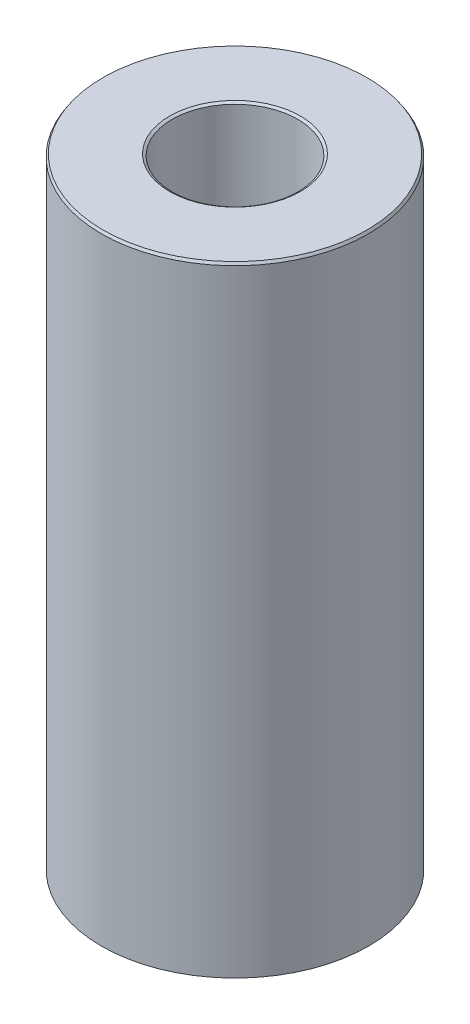
ISO-10303-21;
HEADER;
FILE_DESCRIPTION(('STEP AP214'),'2;1');
FILE_NAME('part.step','',(''),(''),'','','');
FILE_SCHEMA(('AUTOMOTIVE_DESIGN { 1 0 10303 214 1 1 1 1 }'));
ENDSEC;
DATA;
#1=APPLICATION_CONTEXT('core data for automotive mechanical design processes');
#2=APPLICATION_PROTOCOL_DEFINITION('international standard','automotive_design',2000,#1);
#3=PRODUCT_CONTEXT('',#1,'mechanical');
#4=PRODUCT('Part','Part','',(#3));
#5=PRODUCT_RELATED_PRODUCT_CATEGORY('part','',(#4));
#6=PRODUCT_DEFINITION_FORMATION('','',#4);
#7=PRODUCT_DEFINITION_CONTEXT('part definition',#1,'design');
#8=PRODUCT_DEFINITION('design','',#6,#7);
#9=PRODUCT_DEFINITION_SHAPE('','',#8);
#10=(LENGTH_UNIT() NAMED_UNIT(*) SI_UNIT(.MILLI.,.METRE.));
#11=(NAMED_UNIT(*) PLANE_ANGLE_UNIT() SI_UNIT($,.RADIAN.));
#12=(NAMED_UNIT(*) SI_UNIT($,.STERADIAN.) SOLID_ANGLE_UNIT());
#13=UNCERTAINTY_MEASURE_WITH_UNIT(LENGTH_MEASURE(1.E-05),#10,'distance_accuracy_value','');
#14=(GEOMETRIC_REPRESENTATION_CONTEXT(3) GLOBAL_UNCERTAINTY_ASSIGNED_CONTEXT((#13)) GLOBAL_UNIT_ASSIGNED_CONTEXT((#10,
#11,#12)) REPRESENTATION_CONTEXT('',''));
#15=CARTESIAN_POINT('',(0.,0.,0.));
#16=DIRECTION('',(0.,0.,1.));
#17=DIRECTION('',(1.,0.,0.));
#18=AXIS2_PLACEMENT_3D('',#15,#16,#17);
#19=CARTESIAN_POINT('',(0.,127.838153495837,0.));
#20=DIRECTION('',(0.,-1.,0.));
#21=DIRECTION('',(0.,0.,-1.));
#22=AXIS2_PLACEMENT_3D('',#19,#20,#21);
#23=CYLINDRICAL_SURFACE('',#22,27.5);
#24=CARTESIAN_POINT('',(0.,0.324759627285537,0.));
#25=DIRECTION('',(0.,1.,0.));
#26=DIRECTION('',(0.,0.,1.));
#27=AXIS2_PLACEMENT_3D('',#24,#25,#26);
#28=CIRCLE('',#27,27.5);
#29=CARTESIAN_POINT('',(0.,0.324759627285537,27.5));
#30=VERTEX_POINT('',#29);
#31=EDGE_CURVE('E10',#30,#30,#28,.T.);
#32=ORIENTED_EDGE('',*,*,#31,.T.);
#33=EDGE_LOOP('',(#32));
#34=FACE_BOUND('',#33,.T.);
#35=CARTESIAN_POINT('',(0.,127.325558913337,0.));
#36=DIRECTION('',(0.,1.,0.));
#37=DIRECTION('',(0.,0.,1.));
#38=AXIS2_PLACEMENT_3D('',#35,#36,#37);
#39=CIRCLE('',#38,27.5);
#40=CARTESIAN_POINT('',(0.,127.325558913337,27.5));
#41=VERTEX_POINT('',#40);
#42=EDGE_CURVE('E50',#41,#41,#39,.F.);
#43=ORIENTED_EDGE('',*,*,#42,.T.);
#44=EDGE_LOOP('',(#43));
#45=FACE_BOUND('',#44,.T.);
#46=ADVANCED_FACE('F39',(#34,#45),#23,.T.);
#47=CARTESIAN_POINT('',(0.,127.838153495837,0.));
#48=DIRECTION('',(0.,1.,0.));
#49=DIRECTION('',(0.,0.,1.));
#50=AXIS2_PLACEMENT_3D('',#47,#48,#49);
#51=PLANE('',#50);
#52=CARTESIAN_POINT('',(0.,127.838153495837,0.));
#53=DIRECTION('',(0.,1.,0.));
#54=DIRECTION('',(0.,0.,1.));
#55=AXIS2_PLACEMENT_3D('',#52,#53,#54);
#56=CIRCLE('',#55,13.4625229085291);
#57=CARTESIAN_POINT('',(0.,127.838153495837,13.4625229085291));
#58=VERTEX_POINT('',#57);
#59=EDGE_CURVE('E58',#58,#58,#56,.F.);
#60=ORIENTED_EDGE('',*,*,#59,.T.);
#61=EDGE_LOOP('',(#60));
#62=FACE_BOUND('',#61,.T.);
#63=CARTESIAN_POINT('',(0.,127.838153495837,0.));
#64=DIRECTION('',(0.,1.,0.));
#65=DIRECTION('',(0.,0.,1.));
#66=AXIS2_PLACEMENT_3D('',#63,#64,#65);
#67=CIRCLE('',#66,27.1752403727145);
#68=CARTESIAN_POINT('',(0.,127.838153495837,27.1752403727145));
#69=VERTEX_POINT('',#68);
#70=EDGE_CURVE('E61',#69,#69,#67,.T.);
#71=ORIENTED_EDGE('',*,*,#70,.T.);
#72=EDGE_LOOP('',(#71));
#73=FACE_BOUND('',#72,.T.);
#74=ADVANCED_FACE('F88',(#62,#73),#51,.T.);
#75=CARTESIAN_POINT('',(0.,0.,0.));
#76=DIRECTION('',(0.,1.,0.));
#77=DIRECTION('',(0.,0.,1.));
#78=AXIS2_PLACEMENT_3D('',#75,#76,#77);
#79=PLANE('',#78);
#80=CARTESIAN_POINT('',(0.,0.,0.));
#81=DIRECTION('',(0.,1.,0.));
#82=DIRECTION('',(0.,0.,1.));
#83=AXIS2_PLACEMENT_3D('',#80,#81,#82);
#84=CIRCLE('',#83,13.2746879533154);
#85=CARTESIAN_POINT('',(0.,0.,13.2746879533154));
#86=VERTEX_POINT('',#85);
#87=EDGE_CURVE('E51',#86,#86,#84,.T.);
#88=ORIENTED_EDGE('',*,*,#87,.T.);
#89=EDGE_LOOP('',(#88));
#90=FACE_BOUND('',#89,.T.);
#91=CARTESIAN_POINT('',(0.,0.,0.));
#92=DIRECTION('',(0.,1.,0.));
#93=DIRECTION('',(0.,0.,1.));
#94=AXIS2_PLACEMENT_3D('',#91,#92,#93);
#95=CIRCLE('',#94,26.9874054175007);
#96=CARTESIAN_POINT('',(0.,0.,26.9874054175007));
#97=VERTEX_POINT('',#96);
#98=EDGE_CURVE('E54',#97,#97,#95,.F.);
#99=ORIENTED_EDGE('',*,*,#98,.T.);
#100=EDGE_LOOP('',(#99));
#101=FACE_BOUND('',#100,.T.);
#102=ADVANCED_FACE('F83',(#90,#101),#79,.F.);
#103=CARTESIAN_POINT('',(0.,127.838153495837,0.));
#104=DIRECTION('',(0.,-1.,0.));
#105=DIRECTION('',(0.,0.,-1.));
#106=AXIS2_PLACEMENT_3D('',#103,#104,#105);
#107=CYLINDRICAL_SURFACE('',#106,12.9499283260299);
#108=CARTESIAN_POINT('',(0.,127.513393868551,0.));
#109=DIRECTION('',(0.,1.,0.));
#110=DIRECTION('',(0.,0.,1.));
#111=AXIS2_PLACEMENT_3D('',#108,#109,#110);
#112=CIRCLE('',#111,12.9499283260299);
#113=CARTESIAN_POINT('',(0.,127.513393868551,12.9499283260299));
#114=VERTEX_POINT('',#113);
#115=EDGE_CURVE('E67',#114,#114,#112,.T.);
#116=ORIENTED_EDGE('',*,*,#115,.T.);
#117=EDGE_LOOP('',(#116));
#118=FACE_BOUND('',#117,.T.);
#119=CARTESIAN_POINT('',(0.,0.512594582499248,0.));
#120=DIRECTION('',(0.,1.,0.));
#121=DIRECTION('',(0.,0.,1.));
#122=AXIS2_PLACEMENT_3D('',#119,#120,#121);
#123=CIRCLE('',#122,12.9499283260299);
#124=CARTESIAN_POINT('',(0.,0.512594582499248,12.9499283260299));
#125=VERTEX_POINT('',#124);
#126=EDGE_CURVE('E69',#125,#125,#123,.F.);
#127=ORIENTED_EDGE('',*,*,#126,.T.);
#128=EDGE_LOOP('',(#127));
#129=FACE_BOUND('',#128,.T.);
#130=ADVANCED_FACE('F71',(#118,#129),#107,.F.);
#131=CARTESIAN_POINT('',(0.,127.513393868551,0.));
#132=DIRECTION('',(0.,1.,0.));
#133=DIRECTION('',(0.,0.,1.));
#134=AXIS2_PLACEMENT_3D('',#131,#132,#133);
#135=CONICAL_SURFACE('',#134,12.9499283260299,1.00606488991008);
#136=ORIENTED_EDGE('',*,*,#59,.F.);
#137=EDGE_LOOP('',(#136));
#138=FACE_BOUND('',#137,.T.);
#139=ORIENTED_EDGE('',*,*,#115,.F.);
#140=EDGE_LOOP('',(#139));
#141=FACE_BOUND('',#140,.T.);
#142=ADVANCED_FACE('F77',(#138,#141),#135,.F.);
#143=CARTESIAN_POINT('',(0.,0.,0.));
#144=DIRECTION('',(0.,-1.,0.));
#145=DIRECTION('',(0.,0.,-1.));
#146=AXIS2_PLACEMENT_3D('',#143,#144,#145);
#147=CONICAL_SURFACE('',#146,13.2746879533154,0.564731436884825);
#148=ORIENTED_EDGE('',*,*,#126,.F.);
#149=EDGE_LOOP('',(#148));
#150=FACE_BOUND('',#149,.T.);
#151=ORIENTED_EDGE('',*,*,#87,.F.);
#152=EDGE_LOOP('',(#151));
#153=FACE_BOUND('',#152,.T.);
#154=ADVANCED_FACE('F73',(#150,#153),#147,.F.);
#155=CARTESIAN_POINT('',(0.,0.324759627285537,0.));
#156=DIRECTION('',(0.,1.,0.));
#157=DIRECTION('',(0.,0.,1.));
#158=AXIS2_PLACEMENT_3D('',#155,#156,#157);
#159=CONICAL_SURFACE('',#158,27.5,1.00606488991007);
#160=ORIENTED_EDGE('',*,*,#98,.F.);
#161=EDGE_LOOP('',(#160));
#162=FACE_BOUND('',#161,.T.);
#163=ORIENTED_EDGE('',*,*,#31,.F.);
#164=EDGE_LOOP('',(#163));
#165=FACE_BOUND('',#164,.T.);
#166=ADVANCED_FACE('F76',(#162,#165),#159,.T.);
#167=CARTESIAN_POINT('',(0.,127.838153495837,0.));
#168=DIRECTION('',(0.,-1.,0.));
#169=DIRECTION('',(0.,0.,-1.));
#170=AXIS2_PLACEMENT_3D('',#167,#168,#169);
#171=CONICAL_SURFACE('',#170,27.1752403727145,0.564731436884796);
#172=ORIENTED_EDGE('',*,*,#42,.F.);
#173=EDGE_LOOP('',(#172));
#174=FACE_BOUND('',#173,.T.);
#175=ORIENTED_EDGE('',*,*,#70,.F.);
#176=EDGE_LOOP('',(#175));
#177=FACE_BOUND('',#176,.T.);
#178=ADVANCED_FACE('F45',(#174,#177),#171,.T.);
#179=CLOSED_SHELL('',(#46,#74,#102,#130,#142,#154,#166,#178));
#180=MANIFOLD_SOLID_BREP('B2',#179);
#181=ADVANCED_BREP_SHAPE_REPRESENTATION('',(#18,#180),#14);
#182=SHAPE_DEFINITION_REPRESENTATION(#9,#181);
ENDSEC;
END-ISO-10303-21;
